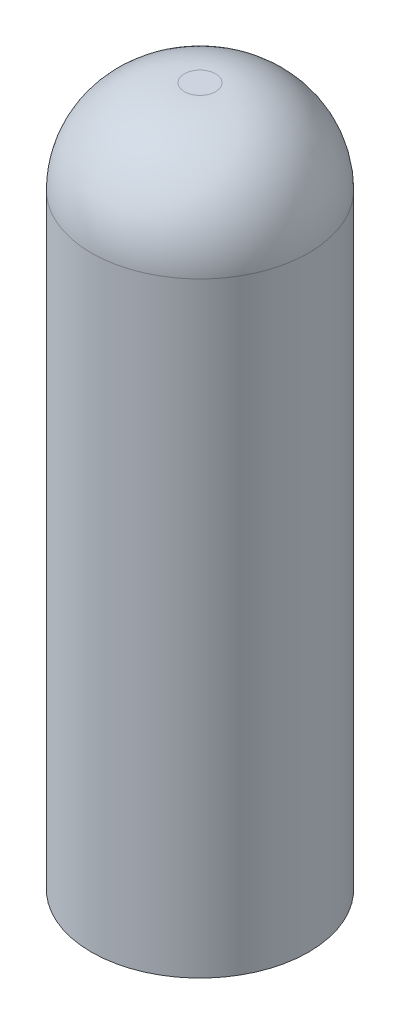
ISO-10303-21;
HEADER;
FILE_DESCRIPTION(('STEP AP214'),'2;1');
FILE_NAME('part.step','',(''),(''),'','','');
FILE_SCHEMA(('AUTOMOTIVE_DESIGN { 1 0 10303 214 1 1 1 1 }'));
ENDSEC;
DATA;
#1=APPLICATION_CONTEXT('core data for automotive mechanical design processes');
#2=APPLICATION_PROTOCOL_DEFINITION('international standard','automotive_design',2000,#1);
#3=PRODUCT_CONTEXT('',#1,'mechanical');
#4=PRODUCT('Part','Part','',(#3));
#5=PRODUCT_RELATED_PRODUCT_CATEGORY('part','',(#4));
#6=PRODUCT_DEFINITION_FORMATION('','',#4);
#7=PRODUCT_DEFINITION_CONTEXT('part definition',#1,'design');
#8=PRODUCT_DEFINITION('design','',#6,#7);
#9=PRODUCT_DEFINITION_SHAPE('','',#8);
#10=(LENGTH_UNIT() NAMED_UNIT(*) SI_UNIT(.MILLI.,.METRE.));
#11=(NAMED_UNIT(*) PLANE_ANGLE_UNIT() SI_UNIT($,.RADIAN.));
#12=(NAMED_UNIT(*) SI_UNIT($,.STERADIAN.) SOLID_ANGLE_UNIT());
#13=UNCERTAINTY_MEASURE_WITH_UNIT(LENGTH_MEASURE(1.E-05),#10,'distance_accuracy_value','');
#14=(GEOMETRIC_REPRESENTATION_CONTEXT(3) GLOBAL_UNCERTAINTY_ASSIGNED_CONTEXT((#13)) GLOBAL_UNIT_ASSIGNED_CONTEXT((#10,
#11,#12)) REPRESENTATION_CONTEXT('',''));
#15=CARTESIAN_POINT('',(0.,0.,0.));
#16=DIRECTION('',(0.,0.,1.));
#17=DIRECTION('',(1.,0.,0.));
#18=AXIS2_PLACEMENT_3D('',#15,#16,#17);
#19=CARTESIAN_POINT('',(0.,45.,0.));
#20=DIRECTION('',(0.,-1.,0.));
#21=DIRECTION('',(0.,0.,-1.));
#22=AXIS2_PLACEMENT_3D('',#19,#20,#21);
#23=CYLINDRICAL_SURFACE('',#22,7.);
#24=CARTESIAN_POINT('',(0.,39.,0.));
#25=DIRECTION('',(0.,1.,0.));
#26=DIRECTION('',(0.,0.,1.));
#27=AXIS2_PLACEMENT_3D('',#24,#25,#26);
#28=CIRCLE('',#27,7.);
#29=CARTESIAN_POINT('',(0.,39.,7.));
#30=VERTEX_POINT('',#29);
#31=EDGE_CURVE('E10',#30,#30,#28,.F.);
#32=ORIENTED_EDGE('',*,*,#31,.T.);
#33=EDGE_LOOP('',(#32));
#34=FACE_BOUND('',#33,.T.);
#35=CARTESIAN_POINT('',(0.,0.,0.));
#36=DIRECTION('',(0.,1.,0.));
#37=DIRECTION('',(0.,0.,1.));
#38=AXIS2_PLACEMENT_3D('',#35,#36,#37);
#39=CIRCLE('',#38,7.);
#40=CARTESIAN_POINT('',(0.,0.,7.));
#41=VERTEX_POINT('',#40);
#42=EDGE_CURVE('E41',#41,#41,#39,.T.);
#43=ORIENTED_EDGE('',*,*,#42,.T.);
#44=EDGE_LOOP('',(#43));
#45=FACE_BOUND('',#44,.T.);
#46=ADVANCED_FACE('F30',(#34,#45),#23,.T.);
#47=CARTESIAN_POINT('',(0.,45.,0.));
#48=DIRECTION('',(0.,1.,0.));
#49=DIRECTION('',(0.,0.,1.));
#50=AXIS2_PLACEMENT_3D('',#47,#48,#49);
#51=PLANE('',#50);
#52=CARTESIAN_POINT('',(0.,45.,0.));
#53=DIRECTION('',(0.,1.,0.));
#54=DIRECTION('',(0.,0.,1.));
#55=AXIS2_PLACEMENT_3D('',#52,#53,#54);
#56=CIRCLE('',#55,1.);
#57=CARTESIAN_POINT('',(0.,45.,1.));
#58=VERTEX_POINT('',#57);
#59=EDGE_CURVE('E37',#58,#58,#56,.T.);
#60=ORIENTED_EDGE('',*,*,#59,.T.);
#61=EDGE_LOOP('',(#60));
#62=FACE_BOUND('',#61,.T.);
#63=ADVANCED_FACE('F65',(#62),#51,.T.);
#64=CARTESIAN_POINT('',(0.,0.,0.));
#65=DIRECTION('',(0.,1.,0.));
#66=DIRECTION('',(0.,0.,1.));
#67=AXIS2_PLACEMENT_3D('',#64,#65,#66);
#68=PLANE('',#67);
#69=CARTESIAN_POINT('',(0.,0.,0.));
#70=DIRECTION('',(0.,-1.,0.));
#71=DIRECTION('',(0.,0.,-1.));
#72=AXIS2_PLACEMENT_3D('',#69,#70,#71);
#73=CIRCLE('',#72,2.05);
#74=CARTESIAN_POINT('',(0.,0.,-2.05));
#75=VERTEX_POINT('',#74);
#76=EDGE_CURVE('E48',#75,#75,#73,.T.);
#77=ORIENTED_EDGE('',*,*,#76,.F.);
#78=EDGE_LOOP('',(#77));
#79=FACE_BOUND('',#78,.T.);
#80=ORIENTED_EDGE('',*,*,#42,.F.);
#81=EDGE_LOOP('',(#80));
#82=FACE_BOUND('',#81,.T.);
#83=ADVANCED_FACE('F62',(#79,#82),#68,.F.);
#84=CARTESIAN_POINT('',(0.,39.,0.));
#85=DIRECTION('',(0.,1.,0.));
#86=DIRECTION('',(0.,0.,1.));
#87=AXIS2_PLACEMENT_3D('',#84,#85,#86);
#88=DEGENERATE_TOROIDAL_SURFACE('',#87,1.,6.,.T.);
#89=ORIENTED_EDGE('',*,*,#31,.F.);
#90=EDGE_LOOP('',(#89));
#91=FACE_BOUND('',#90,.T.);
#92=ORIENTED_EDGE('',*,*,#59,.F.);
#93=EDGE_LOOP('',(#92));
#94=FACE_BOUND('',#93,.T.);
#95=ADVANCED_FACE('F32',(#91,#94),#88,.T.);
#96=CARTESIAN_POINT('',(0.,6.,0.));
#97=DIRECTION('',(0.,-1.,0.));
#98=DIRECTION('',(0.,0.,-1.));
#99=AXIS2_PLACEMENT_3D('',#96,#97,#98);
#100=CYLINDRICAL_SURFACE('',#99,2.05);
#101=CARTESIAN_POINT('',(0.,6.,0.));
#102=DIRECTION('',(0.,-1.,0.));
#103=DIRECTION('',(0.,0.,-1.));
#104=AXIS2_PLACEMENT_3D('',#101,#102,#103);
#105=CIRCLE('',#104,2.05);
#106=CARTESIAN_POINT('',(0.,6.,-2.05));
#107=VERTEX_POINT('',#106);
#108=EDGE_CURVE('E45',#107,#107,#105,.T.);
#109=ORIENTED_EDGE('',*,*,#108,.F.);
#110=EDGE_LOOP('',(#109));
#111=FACE_BOUND('',#110,.T.);
#112=ORIENTED_EDGE('',*,*,#76,.T.);
#113=EDGE_LOOP('',(#112));
#114=FACE_BOUND('',#113,.T.);
#115=ADVANCED_FACE('F56',(#111,#114),#100,.F.);
#116=CARTESIAN_POINT('',(0.,6.,0.));
#117=DIRECTION('',(0.,-1.,0.));
#118=DIRECTION('',(0.,0.,-1.));
#119=AXIS2_PLACEMENT_3D('',#116,#117,#118);
#120=PLANE('',#119);
#121=ORIENTED_EDGE('',*,*,#108,.T.);
#122=EDGE_LOOP('',(#121));
#123=FACE_BOUND('',#122,.T.);
#124=ADVANCED_FACE('F54',(#123),#120,.T.);
#125=CLOSED_SHELL('',(#46,#63,#83,#95,#115,#124));
#126=MANIFOLD_SOLID_BREP('B2',#125);
#127=ADVANCED_BREP_SHAPE_REPRESENTATION('',(#18,#126),#14);
#128=SHAPE_DEFINITION_REPRESENTATION(#9,#127);
ENDSEC;
END-ISO-10303-21;
